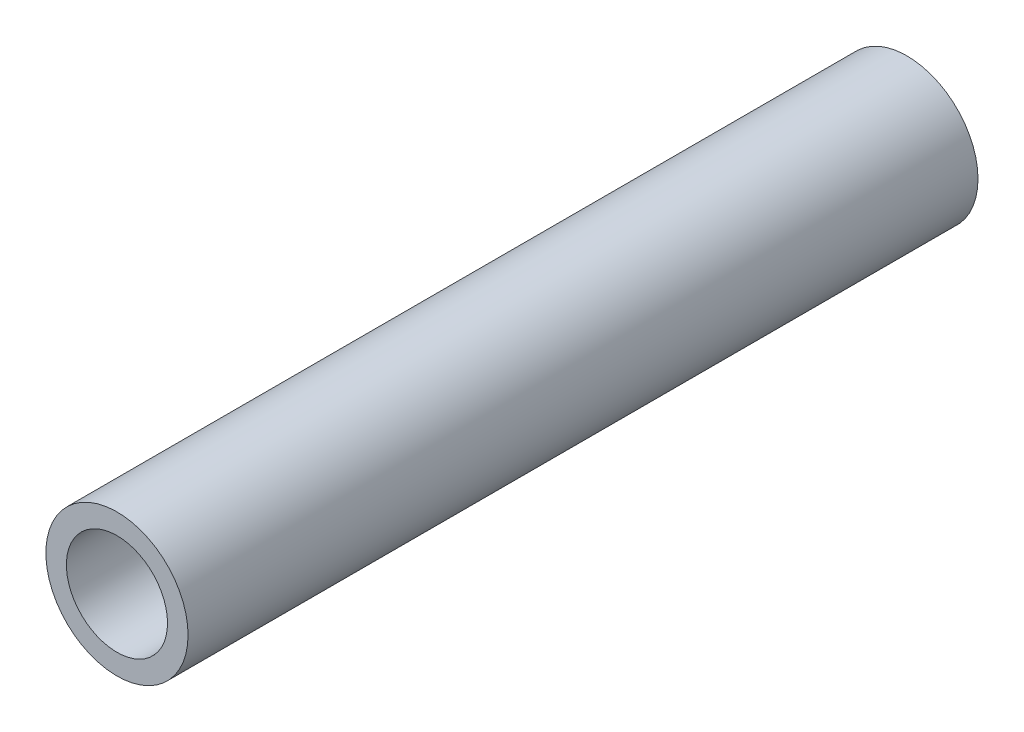
ISO-10303-21;
HEADER;
FILE_DESCRIPTION(('STEP AP214'),'2;1');
FILE_NAME('part.step','',(''),(''),'','','');
FILE_SCHEMA(('AUTOMOTIVE_DESIGN { 1 0 10303 214 1 1 1 1 }'));
ENDSEC;
DATA;
#1=APPLICATION_CONTEXT('core data for automotive mechanical design processes');
#2=APPLICATION_PROTOCOL_DEFINITION('international standard','automotive_design',2000,#1);
#3=PRODUCT_CONTEXT('',#1,'mechanical');
#4=PRODUCT('Part','Part','',(#3));
#5=PRODUCT_RELATED_PRODUCT_CATEGORY('part','',(#4));
#6=PRODUCT_DEFINITION_FORMATION('','',#4);
#7=PRODUCT_DEFINITION_CONTEXT('part definition',#1,'design');
#8=PRODUCT_DEFINITION('design','',#6,#7);
#9=PRODUCT_DEFINITION_SHAPE('','',#8);
#10=(LENGTH_UNIT() NAMED_UNIT(*) SI_UNIT(.MILLI.,.METRE.));
#11=(NAMED_UNIT(*) PLANE_ANGLE_UNIT() SI_UNIT($,.RADIAN.));
#12=(NAMED_UNIT(*) SI_UNIT($,.STERADIAN.) SOLID_ANGLE_UNIT());
#13=UNCERTAINTY_MEASURE_WITH_UNIT(LENGTH_MEASURE(1.E-05),#10,'distance_accuracy_value','');
#14=(GEOMETRIC_REPRESENTATION_CONTEXT(3) GLOBAL_UNCERTAINTY_ASSIGNED_CONTEXT((#13)) GLOBAL_UNIT_ASSIGNED_CONTEXT((#10,
#11,#12)) REPRESENTATION_CONTEXT('',''));
#15=CARTESIAN_POINT('',(0.,0.,0.));
#16=DIRECTION('',(0.,0.,1.));
#17=DIRECTION('',(1.,0.,0.));
#18=AXIS2_PLACEMENT_3D('',#15,#16,#17);
#19=CARTESIAN_POINT('',(0.,0.,12.5));
#20=DIRECTION('',(0.,0.,1.));
#21=DIRECTION('',(1.,0.,0.));
#22=AXIS2_PLACEMENT_3D('',#19,#20,#21);
#23=PLANE('',#22);
#24=CARTESIAN_POINT('',(0.,0.,12.5));
#25=DIRECTION('',(0.,0.,1.));
#26=DIRECTION('',(1.,0.,0.));
#27=AXIS2_PLACEMENT_3D('',#24,#25,#26);
#28=CIRCLE('',#27,2.25);
#29=CARTESIAN_POINT('',(2.25,0.,12.5));
#30=VERTEX_POINT('',#29);
#31=EDGE_CURVE('E10',#30,#30,#28,.T.);
#32=ORIENTED_EDGE('',*,*,#31,.T.);
#33=EDGE_LOOP('',(#32));
#34=FACE_BOUND('',#33,.T.);
#35=CARTESIAN_POINT('',(0.,0.,12.5));
#36=DIRECTION('',(0.,0.,1.));
#37=DIRECTION('',(1.,0.,0.));
#38=AXIS2_PLACEMENT_3D('',#35,#36,#37);
#39=CIRCLE('',#38,1.6);
#40=CARTESIAN_POINT('',(1.6,0.,12.5));
#41=VERTEX_POINT('',#40);
#42=EDGE_CURVE('E50',#41,#41,#39,.T.);
#43=ORIENTED_EDGE('',*,*,#42,.F.);
#44=EDGE_LOOP('',(#43));
#45=FACE_BOUND('',#44,.T.);
#46=ADVANCED_FACE('F37',(#34,#45),#23,.T.);
#47=CARTESIAN_POINT('',(0.,0.,-12.5));
#48=DIRECTION('',(0.,0.,1.));
#49=DIRECTION('',(1.,0.,0.));
#50=AXIS2_PLACEMENT_3D('',#47,#48,#49);
#51=PLANE('',#50);
#52=CARTESIAN_POINT('',(0.,0.,-12.5));
#53=DIRECTION('',(0.,0.,1.));
#54=DIRECTION('',(1.,0.,0.));
#55=AXIS2_PLACEMENT_3D('',#52,#53,#54);
#56=CIRCLE('',#55,2.25);
#57=CARTESIAN_POINT('',(2.25,0.,-12.5));
#58=VERTEX_POINT('',#57);
#59=EDGE_CURVE('E41',#58,#58,#56,.T.);
#60=ORIENTED_EDGE('',*,*,#59,.F.);
#61=EDGE_LOOP('',(#60));
#62=FACE_BOUND('',#61,.T.);
#63=CARTESIAN_POINT('',(0.,0.,-12.5));
#64=DIRECTION('',(0.,0.,1.));
#65=DIRECTION('',(1.,0.,0.));
#66=AXIS2_PLACEMENT_3D('',#63,#64,#65);
#67=CIRCLE('',#66,1.6);
#68=CARTESIAN_POINT('',(1.6,0.,-12.5));
#69=VERTEX_POINT('',#68);
#70=EDGE_CURVE('E52',#69,#69,#67,.T.);
#71=ORIENTED_EDGE('',*,*,#70,.T.);
#72=EDGE_LOOP('',(#71));
#73=FACE_BOUND('',#72,.T.);
#74=ADVANCED_FACE('F64',(#62,#73),#51,.F.);
#75=CARTESIAN_POINT('',(0.,0.,12.5));
#76=DIRECTION('',(0.,0.,-1.));
#77=DIRECTION('',(-1.,0.,0.));
#78=AXIS2_PLACEMENT_3D('',#75,#76,#77);
#79=CYLINDRICAL_SURFACE('',#78,2.25);
#80=ORIENTED_EDGE('',*,*,#31,.F.);
#81=EDGE_LOOP('',(#80));
#82=FACE_BOUND('',#81,.T.);
#83=ORIENTED_EDGE('',*,*,#59,.T.);
#84=EDGE_LOOP('',(#83));
#85=FACE_BOUND('',#84,.T.);
#86=ADVANCED_FACE('F39',(#82,#85),#79,.T.);
#87=CARTESIAN_POINT('',(0.,0.,12.5));
#88=DIRECTION('',(0.,0.,-1.));
#89=DIRECTION('',(-1.,0.,0.));
#90=AXIS2_PLACEMENT_3D('',#87,#88,#89);
#91=CYLINDRICAL_SURFACE('',#90,1.6);
#92=ORIENTED_EDGE('',*,*,#42,.T.);
#93=EDGE_LOOP('',(#92));
#94=FACE_BOUND('',#93,.T.);
#95=ORIENTED_EDGE('',*,*,#70,.F.);
#96=EDGE_LOOP('',(#95));
#97=FACE_BOUND('',#96,.T.);
#98=ADVANCED_FACE('F60',(#94,#97),#91,.F.);
#99=CLOSED_SHELL('',(#46,#74,#86,#98));
#100=MANIFOLD_SOLID_BREP('B2',#99);
#101=ADVANCED_BREP_SHAPE_REPRESENTATION('',(#18,#100),#14);
#102=SHAPE_DEFINITION_REPRESENTATION(#9,#101);
ENDSEC;
END-ISO-10303-21;
